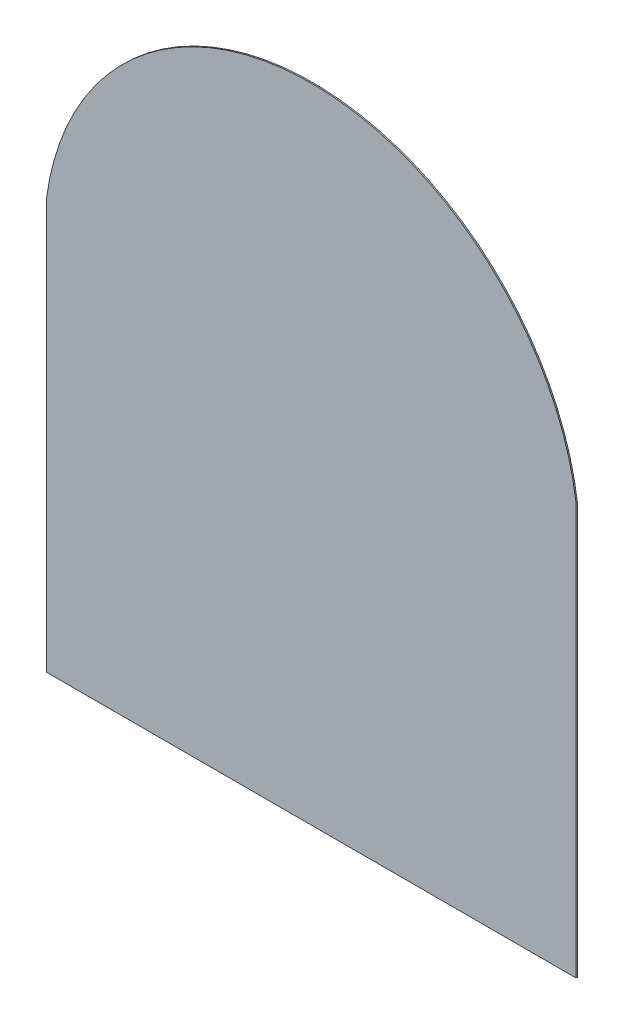
ISO-10303-21;
HEADER;
FILE_DESCRIPTION(('STEP AP214'),'2;1');
FILE_NAME('part.step','',(''),(''),'','','');
FILE_SCHEMA(('AUTOMOTIVE_DESIGN { 1 0 10303 214 1 1 1 1 }'));
ENDSEC;
DATA;
#1=APPLICATION_CONTEXT('core data for automotive mechanical design processes');
#2=APPLICATION_PROTOCOL_DEFINITION('international standard','automotive_design',2000,#1);
#3=PRODUCT_CONTEXT('',#1,'mechanical');
#4=PRODUCT('Part','Part','',(#3));
#5=PRODUCT_RELATED_PRODUCT_CATEGORY('part','',(#4));
#6=PRODUCT_DEFINITION_FORMATION('','',#4);
#7=PRODUCT_DEFINITION_CONTEXT('part definition',#1,'design');
#8=PRODUCT_DEFINITION('design','',#6,#7);
#9=PRODUCT_DEFINITION_SHAPE('','',#8);
#10=(LENGTH_UNIT() NAMED_UNIT(*) SI_UNIT(.MILLI.,.METRE.));
#11=(NAMED_UNIT(*) PLANE_ANGLE_UNIT() SI_UNIT($,.RADIAN.));
#12=(NAMED_UNIT(*) SI_UNIT($,.STERADIAN.) SOLID_ANGLE_UNIT());
#13=UNCERTAINTY_MEASURE_WITH_UNIT(LENGTH_MEASURE(1.E-05),#10,'distance_accuracy_value','');
#14=(GEOMETRIC_REPRESENTATION_CONTEXT(3) GLOBAL_UNCERTAINTY_ASSIGNED_CONTEXT((#13)) GLOBAL_UNIT_ASSIGNED_CONTEXT((#10,
#11,#12)) REPRESENTATION_CONTEXT('',''));
#15=CARTESIAN_POINT('',(0.,0.,0.));
#16=DIRECTION('',(0.,0.,1.));
#17=DIRECTION('',(1.,0.,0.));
#18=AXIS2_PLACEMENT_3D('',#15,#16,#17);
#19=CARTESIAN_POINT('',(-1030.,800.000000000001,2.5));
#20=DIRECTION('',(1.,0.,0.));
#21=DIRECTION('',(0.,0.,-1.));
#22=AXIS2_PLACEMENT_3D('',#19,#20,#21);
#23=PLANE('',#22);
#24=DIRECTION('',(0.,-1.,0.));
#25=VECTOR('',#24,1.);
#26=CARTESIAN_POINT('',(-1030.,800.000000000001,-2.5));
#27=LINE('',#26,#25);
#28=CARTESIAN_POINT('',(-1030.,800.000000000001,-2.5));
#29=VERTEX_POINT('',#28);
#30=CARTESIAN_POINT('',(-1030.,-799.999999999999,-2.5));
#31=VERTEX_POINT('',#30);
#32=EDGE_CURVE('E107',#29,#31,#27,.T.);
#33=ORIENTED_EDGE('',*,*,#32,.T.);
#34=DIRECTION('',(0.,0.,-1.));
#35=VECTOR('',#34,1.);
#36=CARTESIAN_POINT('',(-1030.,-799.999999999999,2.5));
#37=LINE('',#36,#35);
#38=CARTESIAN_POINT('',(-1030.,-799.999999999999,2.5));
#39=VERTEX_POINT('',#38);
#40=EDGE_CURVE('E11',#39,#31,#37,.T.);
#41=ORIENTED_EDGE('',*,*,#40,.F.);
#42=DIRECTION('',(0.,-1.,0.));
#43=VECTOR('',#42,1.);
#44=CARTESIAN_POINT('',(-1030.,800.000000000001,2.5));
#45=LINE('',#44,#43);
#46=CARTESIAN_POINT('',(-1030.,800.000000000001,2.5));
#47=VERTEX_POINT('',#46);
#48=EDGE_CURVE('E91',#47,#39,#45,.T.);
#49=ORIENTED_EDGE('',*,*,#48,.F.);
#50=DIRECTION('',(0.,0.,-1.));
#51=VECTOR('',#50,1.);
#52=CARTESIAN_POINT('',(-1030.,800.000000000001,2.5));
#53=LINE('',#52,#51);
#54=EDGE_CURVE('E103',#47,#29,#53,.T.);
#55=ORIENTED_EDGE('',*,*,#54,.T.);
#56=EDGE_LOOP('',(#33,#41,#49,#55));
#57=FACE_BOUND('',#56,.T.);
#58=ADVANCED_FACE('F39',(#57),#23,.F.);
#59=CARTESIAN_POINT('',(1030.,-799.999999999999,2.5));
#60=DIRECTION('',(0.,1.,0.));
#61=DIRECTION('',(0.,0.,1.));
#62=AXIS2_PLACEMENT_3D('',#59,#60,#61);
#63=PLANE('',#62);
#64=DIRECTION('',(1.,0.,0.));
#65=VECTOR('',#64,1.);
#66=CARTESIAN_POINT('',(1030.,-799.999999999999,-2.5));
#67=LINE('',#66,#65);
#68=CARTESIAN_POINT('',(1030.,-799.999999999999,-2.5));
#69=VERTEX_POINT('',#68);
#70=EDGE_CURVE('E96',#31,#69,#67,.T.);
#71=ORIENTED_EDGE('',*,*,#70,.T.);
#72=DIRECTION('',(0.,0.,-1.));
#73=VECTOR('',#72,1.);
#74=CARTESIAN_POINT('',(1030.,-799.999999999999,2.5));
#75=LINE('',#74,#73);
#76=CARTESIAN_POINT('',(1030.,-799.999999999999,2.5));
#77=VERTEX_POINT('',#76);
#78=EDGE_CURVE('E48',#77,#69,#75,.T.);
#79=ORIENTED_EDGE('',*,*,#78,.F.);
#80=DIRECTION('',(1.,0.,0.));
#81=VECTOR('',#80,1.);
#82=CARTESIAN_POINT('',(1030.,-799.999999999999,2.5));
#83=LINE('',#82,#81);
#84=EDGE_CURVE('E86',#39,#77,#83,.T.);
#85=ORIENTED_EDGE('',*,*,#84,.F.);
#86=ORIENTED_EDGE('',*,*,#40,.T.);
#87=EDGE_LOOP('',(#71,#79,#85,#86));
#88=FACE_BOUND('',#87,.T.);
#89=ADVANCED_FACE('F95',(#88),#63,.F.);
#90=CARTESIAN_POINT('',(1030.,800.000000000001,2.5));
#91=DIRECTION('',(-1.,0.,0.));
#92=DIRECTION('',(0.,-1.,0.));
#93=AXIS2_PLACEMENT_3D('',#90,#91,#92);
#94=PLANE('',#93);
#95=DIRECTION('',(0.,1.,0.));
#96=VECTOR('',#95,1.);
#97=CARTESIAN_POINT('',(1030.,800.000000000001,-2.5));
#98=LINE('',#97,#96);
#99=CARTESIAN_POINT('',(1030.,800.000000000001,-2.5));
#100=VERTEX_POINT('',#99);
#101=EDGE_CURVE('E73',#69,#100,#98,.T.);
#102=ORIENTED_EDGE('',*,*,#101,.T.);
#103=DIRECTION('',(0.,0.,-1.));
#104=VECTOR('',#103,1.);
#105=CARTESIAN_POINT('',(1030.,800.000000000001,2.5));
#106=LINE('',#105,#104);
#107=CARTESIAN_POINT('',(1030.,800.000000000001,2.5));
#108=VERTEX_POINT('',#107);
#109=EDGE_CURVE('E98',#108,#100,#106,.T.);
#110=ORIENTED_EDGE('',*,*,#109,.F.);
#111=DIRECTION('',(0.,1.,0.));
#112=VECTOR('',#111,1.);
#113=CARTESIAN_POINT('',(1030.,800.000000000001,2.5));
#114=LINE('',#113,#112);
#115=EDGE_CURVE('E89',#77,#108,#114,.T.);
#116=ORIENTED_EDGE('',*,*,#115,.F.);
#117=ORIENTED_EDGE('',*,*,#78,.T.);
#118=EDGE_LOOP('',(#102,#110,#116,#117));
#119=FACE_BOUND('',#118,.T.);
#120=ADVANCED_FACE('F99',(#119),#94,.F.);
#121=CARTESIAN_POINT('',(0.,660.611111111113,2.5));
#122=DIRECTION('',(0.,0.,-1.));
#123=DIRECTION('',(-1.,0.,0.));
#124=AXIS2_PLACEMENT_3D('',#121,#122,#123);
#125=CYLINDRICAL_SURFACE('',#124,1039.38888888889);
#126=CARTESIAN_POINT('',(0.,660.611111111113,-2.5));
#127=DIRECTION('',(0.,0.,1.));
#128=DIRECTION('',(-1.,0.,0.));
#129=AXIS2_PLACEMENT_3D('',#126,#127,#128);
#130=CIRCLE('',#129,1039.38888888889);
#131=EDGE_CURVE('E79',#100,#29,#130,.T.);
#132=ORIENTED_EDGE('',*,*,#131,.T.);
#133=ORIENTED_EDGE('',*,*,#54,.F.);
#134=CARTESIAN_POINT('',(0.,660.611111111113,2.5));
#135=DIRECTION('',(0.,0.,1.));
#136=DIRECTION('',(-1.,0.,0.));
#137=AXIS2_PLACEMENT_3D('',#134,#135,#136);
#138=CIRCLE('',#137,1039.38888888889);
#139=EDGE_CURVE('E56',#108,#47,#138,.T.);
#140=ORIENTED_EDGE('',*,*,#139,.F.);
#141=ORIENTED_EDGE('',*,*,#109,.T.);
#142=EDGE_LOOP('',(#132,#133,#140,#141));
#143=FACE_BOUND('',#142,.T.);
#144=ADVANCED_FACE('F120',(#143),#125,.T.);
#145=CARTESIAN_POINT('',(0.,660.611111111113,2.5));
#146=DIRECTION('',(0.,0.,-1.));
#147=DIRECTION('',(-1.,0.,0.));
#148=AXIS2_PLACEMENT_3D('',#145,#146,#147);
#149=PLANE('',#148);
#150=ORIENTED_EDGE('',*,*,#48,.T.);
#151=ORIENTED_EDGE('',*,*,#84,.T.);
#152=ORIENTED_EDGE('',*,*,#115,.T.);
#153=ORIENTED_EDGE('',*,*,#139,.T.);
#154=EDGE_LOOP('',(#150,#151,#152,#153));
#155=FACE_BOUND('',#154,.T.);
#156=ADVANCED_FACE('F87',(#155),#149,.F.);
#157=CARTESIAN_POINT('',(0.,660.611111111113,-2.5));
#158=DIRECTION('',(0.,0.,-1.));
#159=DIRECTION('',(-1.,0.,0.));
#160=AXIS2_PLACEMENT_3D('',#157,#158,#159);
#161=PLANE('',#160);
#162=ORIENTED_EDGE('',*,*,#32,.F.);
#163=ORIENTED_EDGE('',*,*,#131,.F.);
#164=ORIENTED_EDGE('',*,*,#101,.F.);
#165=ORIENTED_EDGE('',*,*,#70,.F.);
#166=EDGE_LOOP('',(#162,#163,#164,#165));
#167=FACE_BOUND('',#166,.T.);
#168=ADVANCED_FACE('F123',(#167),#161,.T.);
#169=CLOSED_SHELL('',(#58,#89,#120,#144,#156,#168));
#170=MANIFOLD_SOLID_BREP('B2',#169);
#171=ADVANCED_BREP_SHAPE_REPRESENTATION('',(#18,#170),#14);
#172=SHAPE_DEFINITION_REPRESENTATION(#9,#171);
ENDSEC;
END-ISO-10303-21;
